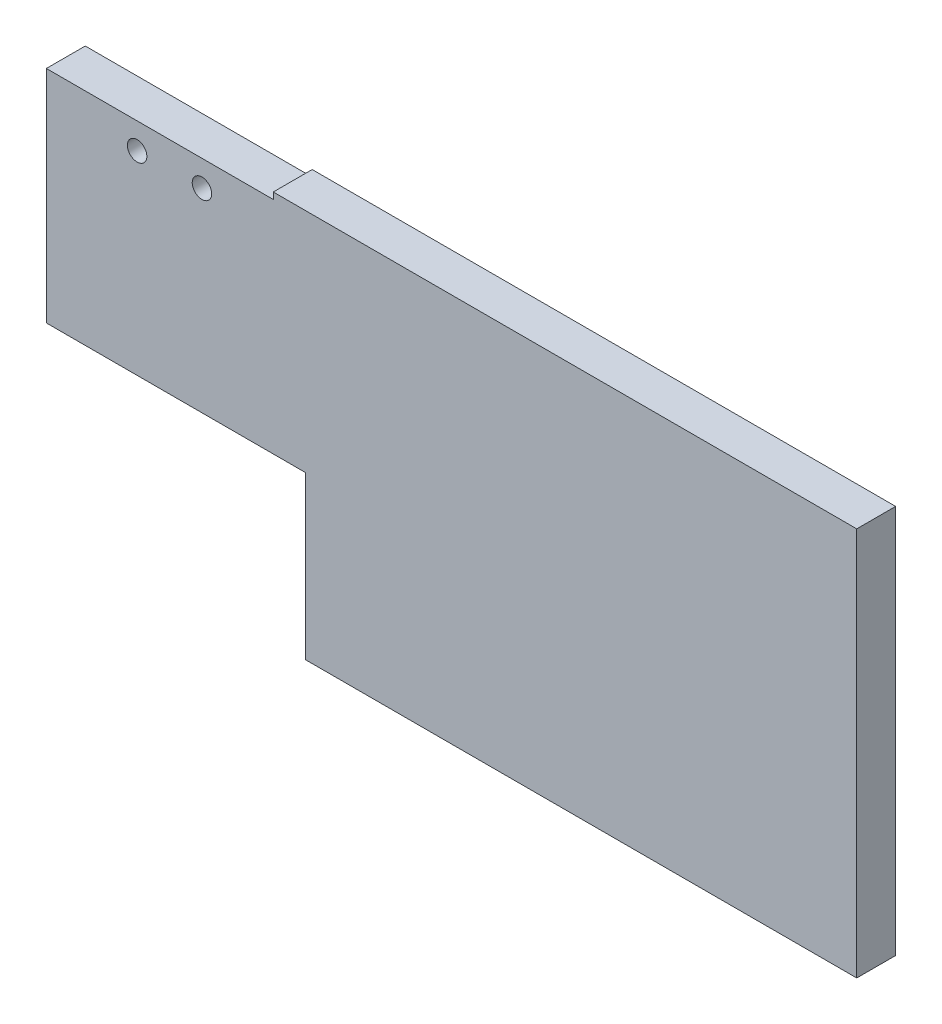
ISO-10303-21;
HEADER;
FILE_DESCRIPTION(('STEP AP214'),'2;1');
FILE_NAME('part.step','',(''),(''),'','','');
FILE_SCHEMA(('AUTOMOTIVE_DESIGN { 1 0 10303 214 1 1 1 1 }'));
ENDSEC;
DATA;
#1=APPLICATION_CONTEXT('core data for automotive mechanical design processes');
#2=APPLICATION_PROTOCOL_DEFINITION('international standard','automotive_design',2000,#1);
#3=PRODUCT_CONTEXT('',#1,'mechanical');
#4=PRODUCT('Part','Part','',(#3));
#5=PRODUCT_RELATED_PRODUCT_CATEGORY('part','',(#4));
#6=PRODUCT_DEFINITION_FORMATION('','',#4);
#7=PRODUCT_DEFINITION_CONTEXT('part definition',#1,'design');
#8=PRODUCT_DEFINITION('design','',#6,#7);
#9=PRODUCT_DEFINITION_SHAPE('','',#8);
#10=(LENGTH_UNIT() NAMED_UNIT(*) SI_UNIT(.MILLI.,.METRE.));
#11=(NAMED_UNIT(*) PLANE_ANGLE_UNIT() SI_UNIT($,.RADIAN.));
#12=(NAMED_UNIT(*) SI_UNIT($,.STERADIAN.) SOLID_ANGLE_UNIT());
#13=UNCERTAINTY_MEASURE_WITH_UNIT(LENGTH_MEASURE(1.E-05),#10,'distance_accuracy_value','');
#14=(GEOMETRIC_REPRESENTATION_CONTEXT(3) GLOBAL_UNCERTAINTY_ASSIGNED_CONTEXT((#13)) GLOBAL_UNIT_ASSIGNED_CONTEXT((#10,
#11,#12)) REPRESENTATION_CONTEXT('',''));
#15=CARTESIAN_POINT('',(0.,0.,0.));
#16=DIRECTION('',(0.,0.,1.));
#17=DIRECTION('',(1.,0.,0.));
#18=AXIS2_PLACEMENT_3D('',#15,#16,#17);
#19=CARTESIAN_POINT('',(0.,0.,6.));
#20=DIRECTION('',(0.,0.,1.));
#21=DIRECTION('',(1.,0.,0.));
#22=AXIS2_PLACEMENT_3D('',#19,#20,#21);
#23=PLANE('',#22);
#24=DIRECTION('',(0.,1.,0.));
#25=VECTOR('',#24,1.);
#26=CARTESIAN_POINT('',(-10.6767705608123,29.4313725490196,6.));
#27=LINE('',#26,#25);
#28=CARTESIAN_POINT('',(-10.6767705608123,28.4313725490196,6.));
#29=VERTEX_POINT('',#28);
#30=CARTESIAN_POINT('',(-10.6767705608123,29.4313725490196,6.));
#31=VERTEX_POINT('',#30);
#32=EDGE_CURVE('E48',#29,#31,#27,.T.);
#33=ORIENTED_EDGE('',*,*,#32,.F.);
#34=DIRECTION('',(1.,0.,0.));
#35=VECTOR('',#34,1.);
#36=CARTESIAN_POINT('',(-10.6767705608123,28.4313725490196,6.));
#37=LINE('',#36,#35);
#38=CARTESIAN_POINT('',(-45.6767705608123,28.4313725490196,6.));
#39=VERTEX_POINT('',#38);
#40=EDGE_CURVE('E115',#39,#29,#37,.T.);
#41=ORIENTED_EDGE('',*,*,#40,.F.);
#42=DIRECTION('',(0.,-1.,0.));
#43=VECTOR('',#42,1.);
#44=CARTESIAN_POINT('',(-45.6767705608123,29.4313725490196,6.));
#45=LINE('',#44,#43);
#46=CARTESIAN_POINT('',(-45.6767705608123,-5.56862745098038,6.));
#47=VERTEX_POINT('',#46);
#48=EDGE_CURVE('E120',#39,#47,#45,.T.);
#49=ORIENTED_EDGE('',*,*,#48,.T.);
#50=DIRECTION('',(-1.,0.,0.));
#51=VECTOR('',#50,1.);
#52=CARTESIAN_POINT('',(-45.6767705608123,-5.56862745098038,6.));
#53=LINE('',#52,#51);
#54=CARTESIAN_POINT('',(-5.67677056081232,-5.56862745098038,6.));
#55=VERTEX_POINT('',#54);
#56=EDGE_CURVE('E170',#55,#47,#53,.T.);
#57=ORIENTED_EDGE('',*,*,#56,.F.);
#58=DIRECTION('',(0.,1.,0.));
#59=VECTOR('',#58,1.);
#60=CARTESIAN_POINT('',(-5.67677056081232,-30.5686274509804,6.));
#61=LINE('',#60,#59);
#62=CARTESIAN_POINT('',(-5.67677056081232,-30.5686274509804,6.));
#63=VERTEX_POINT('',#62);
#64=EDGE_CURVE('E150',#63,#55,#61,.T.);
#65=ORIENTED_EDGE('',*,*,#64,.F.);
#66=DIRECTION('',(1.,0.,0.));
#67=VECTOR('',#66,1.);
#68=CARTESIAN_POINT('',(-45.6767705608123,-30.5686274509804,6.));
#69=LINE('',#68,#67);
#70=CARTESIAN_POINT('',(79.3232294391877,-30.5686274509804,6.));
#71=VERTEX_POINT('',#70);
#72=EDGE_CURVE('E123',#63,#71,#69,.T.);
#73=ORIENTED_EDGE('',*,*,#72,.T.);
#74=DIRECTION('',(0.,1.,0.));
#75=VECTOR('',#74,1.);
#76=CARTESIAN_POINT('',(79.3232294391877,29.4313725490196,6.));
#77=LINE('',#76,#75);
#78=CARTESIAN_POINT('',(79.3232294391877,29.4313725490196,6.));
#79=VERTEX_POINT('',#78);
#80=EDGE_CURVE('E129',#71,#79,#77,.T.);
#81=ORIENTED_EDGE('',*,*,#80,.T.);
#82=DIRECTION('',(-1.,0.,0.));
#83=VECTOR('',#82,1.);
#84=CARTESIAN_POINT('',(-45.6767705608123,29.4313725490196,6.));
#85=LINE('',#84,#83);
#86=EDGE_CURVE('E128',#79,#31,#85,.T.);
#87=ORIENTED_EDGE('',*,*,#86,.T.);
#88=EDGE_LOOP('',(#33,#41,#49,#57,#65,#73,#81,#87));
#89=FACE_BOUND('',#88,.T.);
#90=CARTESIAN_POINT('',(-31.6767705608123,24.4313725490196,6.));
#91=DIRECTION('',(0.,0.,1.));
#92=DIRECTION('',(1.,0.,0.));
#93=AXIS2_PLACEMENT_3D('',#90,#91,#92);
#94=CIRCLE('',#93,1.5);
#95=CARTESIAN_POINT('',(-30.1767705608123,24.4313725490196,6.));
#96=VERTEX_POINT('',#95);
#97=EDGE_CURVE('E136',#96,#96,#94,.T.);
#98=ORIENTED_EDGE('',*,*,#97,.F.);
#99=EDGE_LOOP('',(#98));
#100=FACE_BOUND('',#99,.T.);
#101=CARTESIAN_POINT('',(-21.6767705608123,24.4313725490196,6.));
#102=DIRECTION('',(0.,0.,1.));
#103=DIRECTION('',(1.,0.,0.));
#104=AXIS2_PLACEMENT_3D('',#101,#102,#103);
#105=CIRCLE('',#104,1.5);
#106=CARTESIAN_POINT('',(-20.1767705608123,24.4313725490196,6.));
#107=VERTEX_POINT('',#106);
#108=EDGE_CURVE('E155',#107,#107,#105,.T.);
#109=ORIENTED_EDGE('',*,*,#108,.F.);
#110=EDGE_LOOP('',(#109));
#111=FACE_BOUND('',#110,.T.);
#112=ADVANCED_FACE('F33',(#89,#100,#111),#23,.T.);
#113=CARTESIAN_POINT('',(0.,0.,0.));
#114=DIRECTION('',(0.,0.,1.));
#115=DIRECTION('',(1.,0.,0.));
#116=AXIS2_PLACEMENT_3D('',#113,#114,#115);
#117=PLANE('',#116);
#118=DIRECTION('',(1.,0.,0.));
#119=VECTOR('',#118,1.);
#120=CARTESIAN_POINT('',(-10.6767705608123,28.4313725490196,0.));
#121=LINE('',#120,#119);
#122=CARTESIAN_POINT('',(-45.6767705608123,28.4313725490196,0.));
#123=VERTEX_POINT('',#122);
#124=CARTESIAN_POINT('',(-10.6767705608123,28.4313725490196,0.));
#125=VERTEX_POINT('',#124);
#126=EDGE_CURVE('E106',#123,#125,#121,.T.);
#127=ORIENTED_EDGE('',*,*,#126,.T.);
#128=DIRECTION('',(0.,1.,0.));
#129=VECTOR('',#128,1.);
#130=CARTESIAN_POINT('',(-10.6767705608123,29.4313725490196,0.));
#131=LINE('',#130,#129);
#132=CARTESIAN_POINT('',(-10.6767705608123,29.4313725490196,0.));
#133=VERTEX_POINT('',#132);
#134=EDGE_CURVE('E99',#125,#133,#131,.T.);
#135=ORIENTED_EDGE('',*,*,#134,.T.);
#136=DIRECTION('',(-1.,0.,0.));
#137=VECTOR('',#136,1.);
#138=CARTESIAN_POINT('',(-45.6767705608123,29.4313725490196,0.));
#139=LINE('',#138,#137);
#140=CARTESIAN_POINT('',(79.3232294391877,29.4313725490196,0.));
#141=VERTEX_POINT('',#140);
#142=EDGE_CURVE('E113',#141,#133,#139,.T.);
#143=ORIENTED_EDGE('',*,*,#142,.F.);
#144=DIRECTION('',(0.,1.,0.));
#145=VECTOR('',#144,1.);
#146=CARTESIAN_POINT('',(79.3232294391877,29.4313725490196,0.));
#147=LINE('',#146,#145);
#148=CARTESIAN_POINT('',(79.3232294391877,-30.5686274509804,0.));
#149=VERTEX_POINT('',#148);
#150=EDGE_CURVE('E121',#149,#141,#147,.T.);
#151=ORIENTED_EDGE('',*,*,#150,.F.);
#152=DIRECTION('',(1.,0.,0.));
#153=VECTOR('',#152,1.);
#154=CARTESIAN_POINT('',(-45.6767705608123,-30.5686274509804,0.));
#155=LINE('',#154,#153);
#156=CARTESIAN_POINT('',(-5.67677056081232,-30.5686274509804,0.));
#157=VERTEX_POINT('',#156);
#158=EDGE_CURVE('E125',#157,#149,#155,.T.);
#159=ORIENTED_EDGE('',*,*,#158,.F.);
#160=DIRECTION('',(0.,1.,0.));
#161=VECTOR('',#160,1.);
#162=CARTESIAN_POINT('',(-5.67677056081232,-30.5686274509804,0.));
#163=LINE('',#162,#161);
#164=CARTESIAN_POINT('',(-5.67677056081232,-5.56862745098038,0.));
#165=VERTEX_POINT('',#164);
#166=EDGE_CURVE('E56',#157,#165,#163,.T.);
#167=ORIENTED_EDGE('',*,*,#166,.T.);
#168=DIRECTION('',(-1.,0.,0.));
#169=VECTOR('',#168,1.);
#170=CARTESIAN_POINT('',(-45.6767705608123,-5.56862745098038,0.));
#171=LINE('',#170,#169);
#172=CARTESIAN_POINT('',(-45.6767705608123,-5.56862745098038,0.));
#173=VERTEX_POINT('',#172);
#174=EDGE_CURVE('E166',#165,#173,#171,.T.);
#175=ORIENTED_EDGE('',*,*,#174,.T.);
#176=DIRECTION('',(0.,-1.,0.));
#177=VECTOR('',#176,1.);
#178=CARTESIAN_POINT('',(-45.6767705608123,29.4313725490196,0.));
#179=LINE('',#178,#177);
#180=EDGE_CURVE('E135',#123,#173,#179,.T.);
#181=ORIENTED_EDGE('',*,*,#180,.F.);
#182=EDGE_LOOP('',(#127,#135,#143,#151,#159,#167,#175,#181));
#183=FACE_BOUND('',#182,.T.);
#184=CARTESIAN_POINT('',(-31.6767705608123,24.4313725490196,0.));
#185=DIRECTION('',(0.,0.,1.));
#186=DIRECTION('',(1.,0.,0.));
#187=AXIS2_PLACEMENT_3D('',#184,#185,#186);
#188=CIRCLE('',#187,1.5);
#189=CARTESIAN_POINT('',(-30.1767705608123,24.4313725490196,0.));
#190=VERTEX_POINT('',#189);
#191=EDGE_CURVE('E152',#190,#190,#188,.T.);
#192=ORIENTED_EDGE('',*,*,#191,.T.);
#193=EDGE_LOOP('',(#192));
#194=FACE_BOUND('',#193,.T.);
#195=CARTESIAN_POINT('',(-21.6767705608123,24.4313725490196,0.));
#196=DIRECTION('',(0.,0.,1.));
#197=DIRECTION('',(1.,0.,0.));
#198=AXIS2_PLACEMENT_3D('',#195,#196,#197);
#199=CIRCLE('',#198,1.5);
#200=CARTESIAN_POINT('',(-20.1767705608123,24.4313725490196,0.));
#201=VERTEX_POINT('',#200);
#202=EDGE_CURVE('E158',#201,#201,#199,.T.);
#203=ORIENTED_EDGE('',*,*,#202,.T.);
#204=EDGE_LOOP('',(#203));
#205=FACE_BOUND('',#204,.T.);
#206=ADVANCED_FACE('F110',(#183,#194,#205),#117,.F.);
#207=CARTESIAN_POINT('',(-45.6767705608123,29.4313725490196,6.));
#208=DIRECTION('',(1.,0.,0.));
#209=DIRECTION('',(0.,1.,0.));
#210=AXIS2_PLACEMENT_3D('',#207,#208,#209);
#211=PLANE('',#210);
#212=ORIENTED_EDGE('',*,*,#48,.F.);
#213=DIRECTION('',(0.,0.,1.));
#214=VECTOR('',#213,1.);
#215=CARTESIAN_POINT('',(-45.6767705608123,28.4313725490196,0.));
#216=LINE('',#215,#214);
#217=EDGE_CURVE('E105',#123,#39,#216,.T.);
#218=ORIENTED_EDGE('',*,*,#217,.F.);
#219=ORIENTED_EDGE('',*,*,#180,.T.);
#220=DIRECTION('',(0.,0.,1.));
#221=VECTOR('',#220,1.);
#222=CARTESIAN_POINT('',(-45.6767705608123,-5.56862745098038,0.));
#223=LINE('',#222,#221);
#224=EDGE_CURVE('E161',#173,#47,#223,.T.);
#225=ORIENTED_EDGE('',*,*,#224,.T.);
#226=EDGE_LOOP('',(#212,#218,#219,#225));
#227=FACE_BOUND('',#226,.T.);
#228=ADVANCED_FACE('F35',(#227),#211,.F.);
#229=CARTESIAN_POINT('',(-45.6767705608123,-30.5686274509804,6.));
#230=DIRECTION('',(0.,1.,0.));
#231=DIRECTION('',(0.,0.,1.));
#232=AXIS2_PLACEMENT_3D('',#229,#230,#231);
#233=PLANE('',#232);
#234=ORIENTED_EDGE('',*,*,#72,.F.);
#235=DIRECTION('',(0.,0.,1.));
#236=VECTOR('',#235,1.);
#237=CARTESIAN_POINT('',(-5.67677056081232,-30.5686274509804,0.));
#238=LINE('',#237,#236);
#239=EDGE_CURVE('E143',#157,#63,#238,.T.);
#240=ORIENTED_EDGE('',*,*,#239,.F.);
#241=ORIENTED_EDGE('',*,*,#158,.T.);
#242=DIRECTION('',(0.,0.,-1.));
#243=VECTOR('',#242,1.);
#244=CARTESIAN_POINT('',(79.3232294391877,-30.5686274509804,6.));
#245=LINE('',#244,#243);
#246=EDGE_CURVE('E11',#71,#149,#245,.T.);
#247=ORIENTED_EDGE('',*,*,#246,.F.);
#248=EDGE_LOOP('',(#234,#240,#241,#247));
#249=FACE_BOUND('',#248,.T.);
#250=ADVANCED_FACE('F141',(#249),#233,.F.);
#251=CARTESIAN_POINT('',(79.3232294391877,29.4313725490196,6.));
#252=DIRECTION('',(-1.,0.,0.));
#253=DIRECTION('',(0.,-1.,0.));
#254=AXIS2_PLACEMENT_3D('',#251,#252,#253);
#255=PLANE('',#254);
#256=ORIENTED_EDGE('',*,*,#150,.T.);
#257=DIRECTION('',(0.,0.,-1.));
#258=VECTOR('',#257,1.);
#259=CARTESIAN_POINT('',(79.3232294391877,29.4313725490196,6.));
#260=LINE('',#259,#258);
#261=EDGE_CURVE('E41',#79,#141,#260,.T.);
#262=ORIENTED_EDGE('',*,*,#261,.F.);
#263=ORIENTED_EDGE('',*,*,#80,.F.);
#264=ORIENTED_EDGE('',*,*,#246,.T.);
#265=EDGE_LOOP('',(#256,#262,#263,#264));
#266=FACE_BOUND('',#265,.T.);
#267=ADVANCED_FACE('F145',(#266),#255,.F.);
#268=CARTESIAN_POINT('',(-45.6767705608123,29.4313725490196,6.));
#269=DIRECTION('',(0.,-1.,0.));
#270=DIRECTION('',(1.,0.,0.));
#271=AXIS2_PLACEMENT_3D('',#268,#269,#270);
#272=PLANE('',#271);
#273=ORIENTED_EDGE('',*,*,#142,.T.);
#274=DIRECTION('',(0.,0.,1.));
#275=VECTOR('',#274,1.);
#276=CARTESIAN_POINT('',(-10.6767705608123,29.4313725490196,0.));
#277=LINE('',#276,#275);
#278=EDGE_CURVE('E96',#133,#31,#277,.T.);
#279=ORIENTED_EDGE('',*,*,#278,.T.);
#280=ORIENTED_EDGE('',*,*,#86,.F.);
#281=ORIENTED_EDGE('',*,*,#261,.T.);
#282=EDGE_LOOP('',(#273,#279,#280,#281));
#283=FACE_BOUND('',#282,.T.);
#284=ADVANCED_FACE('F118',(#283),#272,.F.);
#285=CARTESIAN_POINT('',(-31.6767705608123,24.4313725490196,6.));
#286=DIRECTION('',(0.,0.,-1.));
#287=DIRECTION('',(-1.,0.,0.));
#288=AXIS2_PLACEMENT_3D('',#285,#286,#287);
#289=CYLINDRICAL_SURFACE('',#288,1.5);
#290=ORIENTED_EDGE('',*,*,#97,.T.);
#291=EDGE_LOOP('',(#290));
#292=FACE_BOUND('',#291,.T.);
#293=ORIENTED_EDGE('',*,*,#191,.F.);
#294=EDGE_LOOP('',(#293));
#295=FACE_BOUND('',#294,.T.);
#296=ADVANCED_FACE('F211',(#292,#295),#289,.F.);
#297=CARTESIAN_POINT('',(-21.6767705608123,24.4313725490196,6.));
#298=DIRECTION('',(0.,0.,-1.));
#299=DIRECTION('',(-1.,0.,0.));
#300=AXIS2_PLACEMENT_3D('',#297,#298,#299);
#301=CYLINDRICAL_SURFACE('',#300,1.5);
#302=ORIENTED_EDGE('',*,*,#108,.T.);
#303=EDGE_LOOP('',(#302));
#304=FACE_BOUND('',#303,.T.);
#305=ORIENTED_EDGE('',*,*,#202,.F.);
#306=EDGE_LOOP('',(#305));
#307=FACE_BOUND('',#306,.T.);
#308=ADVANCED_FACE('F201',(#304,#307),#301,.F.);
#309=CARTESIAN_POINT('',(-45.6767705608123,-5.56862745098038,0.));
#310=DIRECTION('',(0.,1.,0.));
#311=DIRECTION('',(0.,0.,1.));
#312=AXIS2_PLACEMENT_3D('',#309,#310,#311);
#313=PLANE('',#312);
#314=ORIENTED_EDGE('',*,*,#56,.T.);
#315=ORIENTED_EDGE('',*,*,#224,.F.);
#316=ORIENTED_EDGE('',*,*,#174,.F.);
#317=DIRECTION('',(0.,0.,1.));
#318=VECTOR('',#317,1.);
#319=CARTESIAN_POINT('',(-5.67677056081232,-5.56862745098038,0.));
#320=LINE('',#319,#318);
#321=EDGE_CURVE('E165',#165,#55,#320,.T.);
#322=ORIENTED_EDGE('',*,*,#321,.T.);
#323=EDGE_LOOP('',(#314,#315,#316,#322));
#324=FACE_BOUND('',#323,.T.);
#325=ADVANCED_FACE('F192',(#324),#313,.F.);
#326=CARTESIAN_POINT('',(-5.67677056081232,-30.5686274509804,0.));
#327=DIRECTION('',(1.,0.,0.));
#328=DIRECTION('',(0.,0.,-1.));
#329=AXIS2_PLACEMENT_3D('',#326,#327,#328);
#330=PLANE('',#329);
#331=ORIENTED_EDGE('',*,*,#64,.T.);
#332=ORIENTED_EDGE('',*,*,#321,.F.);
#333=ORIENTED_EDGE('',*,*,#166,.F.);
#334=ORIENTED_EDGE('',*,*,#239,.T.);
#335=EDGE_LOOP('',(#331,#332,#333,#334));
#336=FACE_BOUND('',#335,.T.);
#337=ADVANCED_FACE('F193',(#336),#330,.F.);
#338=CARTESIAN_POINT('',(-10.6767705608123,29.4313725490196,0.));
#339=DIRECTION('',(1.,0.,0.));
#340=DIRECTION('',(0.,0.,-1.));
#341=AXIS2_PLACEMENT_3D('',#338,#339,#340);
#342=PLANE('',#341);
#343=ORIENTED_EDGE('',*,*,#32,.T.);
#344=ORIENTED_EDGE('',*,*,#278,.F.);
#345=ORIENTED_EDGE('',*,*,#134,.F.);
#346=DIRECTION('',(0.,0.,1.));
#347=VECTOR('',#346,1.);
#348=CARTESIAN_POINT('',(-10.6767705608123,28.4313725490196,0.));
#349=LINE('',#348,#347);
#350=EDGE_CURVE('E174',#125,#29,#349,.T.);
#351=ORIENTED_EDGE('',*,*,#350,.T.);
#352=EDGE_LOOP('',(#343,#344,#345,#351));
#353=FACE_BOUND('',#352,.T.);
#354=ADVANCED_FACE('F98',(#353),#342,.F.);
#355=CARTESIAN_POINT('',(-10.6767705608123,28.4313725490196,0.));
#356=DIRECTION('',(0.,-1.,0.));
#357=DIRECTION('',(1.,0.,0.));
#358=AXIS2_PLACEMENT_3D('',#355,#356,#357);
#359=PLANE('',#358);
#360=ORIENTED_EDGE('',*,*,#40,.T.);
#361=ORIENTED_EDGE('',*,*,#350,.F.);
#362=ORIENTED_EDGE('',*,*,#126,.F.);
#363=ORIENTED_EDGE('',*,*,#217,.T.);
#364=EDGE_LOOP('',(#360,#361,#362,#363));
#365=FACE_BOUND('',#364,.T.);
#366=ADVANCED_FACE('F185',(#365),#359,.F.);
#367=CLOSED_SHELL('',(#112,#206,#228,#250,#267,#284,#296,#308,#325,#337,#354,#366));
#368=MANIFOLD_SOLID_BREP('B2',#367);
#369=ADVANCED_BREP_SHAPE_REPRESENTATION('',(#18,#368),#14);
#370=SHAPE_DEFINITION_REPRESENTATION(#9,#369);
ENDSEC;
END-ISO-10303-21;
